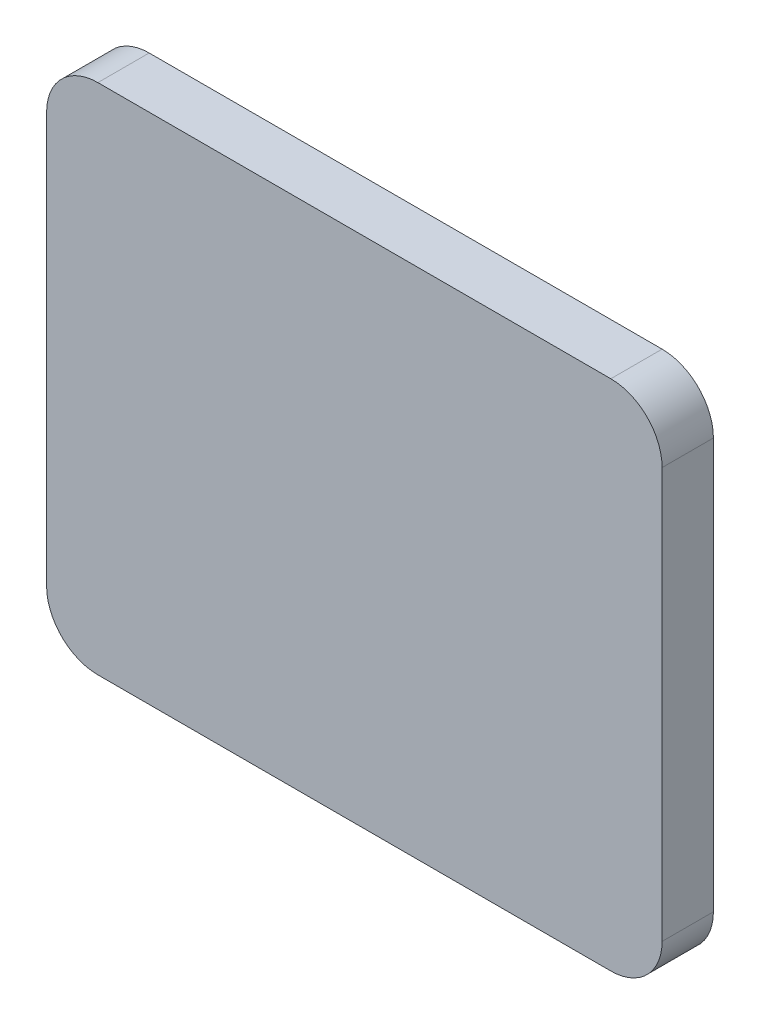
ISO-10303-21;
HEADER;
FILE_DESCRIPTION(('STEP AP214'),'2;1');
FILE_NAME('part.step','',(''),(''),'','','');
FILE_SCHEMA(('AUTOMOTIVE_DESIGN { 1 0 10303 214 1 1 1 1 }'));
ENDSEC;
DATA;
#1=APPLICATION_CONTEXT('core data for automotive mechanical design processes');
#2=APPLICATION_PROTOCOL_DEFINITION('international standard','automotive_design',2000,#1);
#3=PRODUCT_CONTEXT('',#1,'mechanical');
#4=PRODUCT('Part','Part','',(#3));
#5=PRODUCT_RELATED_PRODUCT_CATEGORY('part','',(#4));
#6=PRODUCT_DEFINITION_FORMATION('','',#4);
#7=PRODUCT_DEFINITION_CONTEXT('part definition',#1,'design');
#8=PRODUCT_DEFINITION('design','',#6,#7);
#9=PRODUCT_DEFINITION_SHAPE('','',#8);
#10=(LENGTH_UNIT() NAMED_UNIT(*) SI_UNIT(.MILLI.,.METRE.));
#11=(NAMED_UNIT(*) PLANE_ANGLE_UNIT() SI_UNIT($,.RADIAN.));
#12=(NAMED_UNIT(*) SI_UNIT($,.STERADIAN.) SOLID_ANGLE_UNIT());
#13=UNCERTAINTY_MEASURE_WITH_UNIT(LENGTH_MEASURE(1.E-05),#10,'distance_accuracy_value','');
#14=(GEOMETRIC_REPRESENTATION_CONTEXT(3) GLOBAL_UNCERTAINTY_ASSIGNED_CONTEXT((#13)) GLOBAL_UNIT_ASSIGNED_CONTEXT((#10,
#11,#12)) REPRESENTATION_CONTEXT('',''));
#15=CARTESIAN_POINT('',(0.,0.,0.));
#16=DIRECTION('',(0.,0.,1.));
#17=DIRECTION('',(1.,0.,0.));
#18=AXIS2_PLACEMENT_3D('',#15,#16,#17);
#19=CARTESIAN_POINT('',(-4.99999999994,-4.999999999969,1.));
#20=DIRECTION('',(0.,0.,-1.));
#21=DIRECTION('',(0.,1.,0.));
#22=AXIS2_PLACEMENT_3D('',#19,#20,#21);
#23=PLANE('',#22);
#24=CARTESIAN_POINT('',(5.000000000026,-4.000000000026,1.));
#25=DIRECTION('',(0.,0.,-1.));
#26=DIRECTION('',(0.,1.,0.));
#27=AXIS2_PLACEMENT_3D('',#24,#25,#26);
#28=CIRCLE('',#27,0.999999999974);
#29=CARTESIAN_POINT('',(6.,-4.000000000026,1.));
#30=VERTEX_POINT('',#29);
#31=CARTESIAN_POINT('',(5.000000000026,-4.999999999969,1.));
#32=VERTEX_POINT('',#31);
#33=EDGE_CURVE('E94',#30,#32,#28,.T.);
#34=ORIENTED_EDGE('',*,*,#33,.F.);
#35=DIRECTION('',(0.,1.,0.));
#36=VECTOR('',#35,1.);
#37=CARTESIAN_POINT('',(6.,-4.000000000026,1.));
#38=LINE('',#37,#36);
#39=CARTESIAN_POINT('',(6.,4.000000000018,1.));
#40=VERTEX_POINT('',#39);
#41=EDGE_CURVE('E103',#30,#40,#38,.T.);
#42=ORIENTED_EDGE('',*,*,#41,.T.);
#43=CARTESIAN_POINT('',(5.000000000026,4.000000000018,1.));
#44=DIRECTION('',(0.,0.,-1.));
#45=DIRECTION('',(0.,1.,0.));
#46=AXIS2_PLACEMENT_3D('',#43,#44,#45);
#47=CIRCLE('',#46,0.999999999974);
#48=CARTESIAN_POINT('',(5.000000000026,4.999999999992,1.));
#49=VERTEX_POINT('',#48);
#50=EDGE_CURVE('E106',#49,#40,#47,.T.);
#51=ORIENTED_EDGE('',*,*,#50,.F.);
#52=DIRECTION('',(1.,0.,0.));
#53=VECTOR('',#52,1.);
#54=CARTESIAN_POINT('',(5.000000000026,4.999999999992,1.));
#55=LINE('',#54,#53);
#56=CARTESIAN_POINT('',(-4.999999999989,4.999999999992,1.));
#57=VERTEX_POINT('',#56);
#58=EDGE_CURVE('E107',#49,#57,#55,.F.);
#59=ORIENTED_EDGE('',*,*,#58,.T.);
#60=CARTESIAN_POINT('',(-4.999999999989,4.000000000018,1.));
#61=DIRECTION('',(0.,0.,-1.));
#62=DIRECTION('',(0.,1.,0.));
#63=AXIS2_PLACEMENT_3D('',#60,#61,#62);
#64=CIRCLE('',#63,0.999999999974);
#65=CARTESIAN_POINT('',(-5.9999999999815,4.000000000025,1.));
#66=VERTEX_POINT('',#65);
#67=EDGE_CURVE('E110',#66,#57,#64,.T.);
#68=ORIENTED_EDGE('',*,*,#67,.F.);
#69=DIRECTION('',(0.,1.,0.));
#70=VECTOR('',#69,1.);
#71=CARTESIAN_POINT('',(-6.,4.00000000005,1.));
#72=LINE('',#71,#70);
#73=CARTESIAN_POINT('',(-6.,-3.999999999995,1.));
#74=VERTEX_POINT('',#73);
#75=EDGE_CURVE('E85',#66,#74,#72,.F.);
#76=ORIENTED_EDGE('',*,*,#75,.T.);
#77=CARTESIAN_POINT('',(-5.000000000026,-3.999999999995,1.));
#78=DIRECTION('',(0.,0.,-1.));
#79=DIRECTION('',(0.,1.,0.));
#80=AXIS2_PLACEMENT_3D('',#77,#78,#79);
#81=CIRCLE('',#80,0.999999999974);
#82=CARTESIAN_POINT('',(-4.999999999983,-4.999999999969,1.));
#83=VERTEX_POINT('',#82);
#84=EDGE_CURVE('E20',#83,#74,#81,.T.);
#85=ORIENTED_EDGE('',*,*,#84,.F.);
#86=DIRECTION('',(1.,0.,0.));
#87=VECTOR('',#86,1.);
#88=CARTESIAN_POINT('',(-4.99999999994,-4.999999999969,1.));
#89=LINE('',#88,#87);
#90=EDGE_CURVE('E83',#83,#32,#89,.T.);
#91=ORIENTED_EDGE('',*,*,#90,.T.);
#92=EDGE_LOOP('',(#34,#42,#51,#59,#68,#76,#85,#91));
#93=FACE_BOUND('',#92,.T.);
#94=ADVANCED_FACE('F17',(#93),#23,.F.);
#95=CARTESIAN_POINT('',(-5.000000000026,-3.999999999995,0.));
#96=DIRECTION('',(0.,0.,-1.));
#97=DIRECTION('',(0.,1.,0.));
#98=AXIS2_PLACEMENT_3D('',#95,#96,#97);
#99=CYLINDRICAL_SURFACE('',#98,0.999999999974);
#100=ORIENTED_EDGE('',*,*,#84,.T.);
#101=DIRECTION('',(0.,0.,-1.));
#102=VECTOR('',#101,1.);
#103=CARTESIAN_POINT('',(-6.,-3.999999999995,0.));
#104=LINE('',#103,#102);
#105=CARTESIAN_POINT('',(-6.,-3.999999999995,0.));
#106=VERTEX_POINT('',#105);
#107=EDGE_CURVE('E101',#74,#106,#104,.T.);
#108=ORIENTED_EDGE('',*,*,#107,.T.);
#109=CARTESIAN_POINT('',(-5.000000000026,-3.999999999995,0.));
#110=DIRECTION('',(0.,0.,-1.));
#111=DIRECTION('',(0.,1.,0.));
#112=AXIS2_PLACEMENT_3D('',#109,#110,#111);
#113=CIRCLE('',#112,0.999999999974);
#114=CARTESIAN_POINT('',(-4.999999999983,-4.9999999999765,0.));
#115=VERTEX_POINT('',#114);
#116=EDGE_CURVE('E92',#115,#106,#113,.T.);
#117=ORIENTED_EDGE('',*,*,#116,.F.);
#118=DIRECTION('',(0.,0.,1.));
#119=VECTOR('',#118,1.);
#120=CARTESIAN_POINT('',(-4.99999999994,-4.999999999969,0.));
#121=LINE('',#120,#119);
#122=EDGE_CURVE('E89',#115,#83,#121,.T.);
#123=ORIENTED_EDGE('',*,*,#122,.T.);
#124=EDGE_LOOP('',(#100,#108,#117,#123));
#125=FACE_BOUND('',#124,.T.);
#126=ADVANCED_FACE('F90',(#125),#99,.T.);
#127=CARTESIAN_POINT('',(-6.,4.00000000005,0.));
#128=DIRECTION('',(1.,0.,0.));
#129=DIRECTION('',(0.,0.,-1.));
#130=AXIS2_PLACEMENT_3D('',#127,#128,#129);
#131=PLANE('',#130);
#132=ORIENTED_EDGE('',*,*,#107,.F.);
#133=ORIENTED_EDGE('',*,*,#75,.F.);
#134=DIRECTION('',(0.,0.,-1.));
#135=VECTOR('',#134,1.);
#136=CARTESIAN_POINT('',(-5.999999999963,4.000000000032,0.));
#137=LINE('',#136,#135);
#138=CARTESIAN_POINT('',(-5.9999999999815,4.000000000025,0.));
#139=VERTEX_POINT('',#138);
#140=EDGE_CURVE('E129',#139,#66,#137,.F.);
#141=ORIENTED_EDGE('',*,*,#140,.F.);
#142=DIRECTION('',(0.,1.,0.));
#143=VECTOR('',#142,1.);
#144=CARTESIAN_POINT('',(-6.,-4.999999999969,0.));
#145=LINE('',#144,#143);
#146=EDGE_CURVE('E122',#106,#139,#145,.T.);
#147=ORIENTED_EDGE('',*,*,#146,.F.);
#148=EDGE_LOOP('',(#132,#133,#141,#147));
#149=FACE_BOUND('',#148,.T.);
#150=ADVANCED_FACE('F216',(#149),#131,.F.);
#151=CARTESIAN_POINT('',(-4.999999999989,4.000000000018,0.));
#152=DIRECTION('',(0.,0.,-1.));
#153=DIRECTION('',(0.,1.,0.));
#154=AXIS2_PLACEMENT_3D('',#151,#152,#153);
#155=CYLINDRICAL_SURFACE('',#154,0.999999999974);
#156=ORIENTED_EDGE('',*,*,#67,.T.);
#157=DIRECTION('',(0.,0.,-1.));
#158=VECTOR('',#157,1.);
#159=CARTESIAN_POINT('',(-4.999999999989,4.999999999992,0.));
#160=LINE('',#159,#158);
#161=CARTESIAN_POINT('',(-4.999999999989,4.999999999992,0.));
#162=VERTEX_POINT('',#161);
#163=EDGE_CURVE('E109',#57,#162,#160,.T.);
#164=ORIENTED_EDGE('',*,*,#163,.T.);
#165=CARTESIAN_POINT('',(-4.999999999989,4.000000000018,0.));
#166=DIRECTION('',(0.,0.,-1.));
#167=DIRECTION('',(0.,1.,0.));
#168=AXIS2_PLACEMENT_3D('',#165,#166,#167);
#169=CIRCLE('',#168,0.999999999974);
#170=EDGE_CURVE('E119',#139,#162,#169,.T.);
#171=ORIENTED_EDGE('',*,*,#170,.F.);
#172=ORIENTED_EDGE('',*,*,#140,.T.);
#173=EDGE_LOOP('',(#156,#164,#171,#172));
#174=FACE_BOUND('',#173,.T.);
#175=ADVANCED_FACE('F206',(#174),#155,.T.);
#176=CARTESIAN_POINT('',(5.000000000026,4.999999999992,0.));
#177=DIRECTION('',(0.,-1.,0.));
#178=DIRECTION('',(0.,0.,-1.));
#179=AXIS2_PLACEMENT_3D('',#176,#177,#178);
#180=PLANE('',#179);
#181=ORIENTED_EDGE('',*,*,#163,.F.);
#182=ORIENTED_EDGE('',*,*,#58,.F.);
#183=DIRECTION('',(0.,0.,-1.));
#184=VECTOR('',#183,1.);
#185=CARTESIAN_POINT('',(5.000000000026,4.999999999992,0.));
#186=LINE('',#185,#184);
#187=CARTESIAN_POINT('',(5.000000000026,4.999999999992,0.));
#188=VERTEX_POINT('',#187);
#189=EDGE_CURVE('E127',#188,#49,#186,.F.);
#190=ORIENTED_EDGE('',*,*,#189,.F.);
#191=DIRECTION('',(1.,0.,0.));
#192=VECTOR('',#191,1.);
#193=CARTESIAN_POINT('',(-4.99999999994,4.999999999992,0.));
#194=LINE('',#193,#192);
#195=EDGE_CURVE('E118',#162,#188,#194,.T.);
#196=ORIENTED_EDGE('',*,*,#195,.F.);
#197=EDGE_LOOP('',(#181,#182,#190,#196));
#198=FACE_BOUND('',#197,.T.);
#199=ADVANCED_FACE('F196',(#198),#180,.F.);
#200=CARTESIAN_POINT('',(5.000000000026,4.000000000018,0.));
#201=DIRECTION('',(0.,0.,-1.));
#202=DIRECTION('',(0.,1.,0.));
#203=AXIS2_PLACEMENT_3D('',#200,#201,#202);
#204=CYLINDRICAL_SURFACE('',#203,0.999999999974);
#205=ORIENTED_EDGE('',*,*,#50,.T.);
#206=DIRECTION('',(0.,0.,1.));
#207=VECTOR('',#206,1.);
#208=CARTESIAN_POINT('',(6.,4.000000000018,0.));
#209=LINE('',#208,#207);
#210=CARTESIAN_POINT('',(6.,4.000000000018,0.));
#211=VERTEX_POINT('',#210);
#212=EDGE_CURVE('E105',#40,#211,#209,.F.);
#213=ORIENTED_EDGE('',*,*,#212,.T.);
#214=CARTESIAN_POINT('',(5.000000000026,4.000000000018,0.));
#215=DIRECTION('',(0.,0.,-1.));
#216=DIRECTION('',(0.,1.,0.));
#217=AXIS2_PLACEMENT_3D('',#214,#215,#216);
#218=CIRCLE('',#217,0.999999999974);
#219=EDGE_CURVE('E115',#188,#211,#218,.T.);
#220=ORIENTED_EDGE('',*,*,#219,.F.);
#221=ORIENTED_EDGE('',*,*,#189,.T.);
#222=EDGE_LOOP('',(#205,#213,#220,#221));
#223=FACE_BOUND('',#222,.T.);
#224=ADVANCED_FACE('F162',(#223),#204,.T.);
#225=CARTESIAN_POINT('',(6.,-4.000000000026,0.));
#226=DIRECTION('',(-1.,0.,0.));
#227=DIRECTION('',(0.,0.,1.));
#228=AXIS2_PLACEMENT_3D('',#225,#226,#227);
#229=PLANE('',#228);
#230=ORIENTED_EDGE('',*,*,#212,.F.);
#231=ORIENTED_EDGE('',*,*,#41,.F.);
#232=DIRECTION('',(0.,0.,-1.));
#233=VECTOR('',#232,1.);
#234=CARTESIAN_POINT('',(6.,-4.000000000026,0.));
#235=LINE('',#234,#233);
#236=CARTESIAN_POINT('',(6.,-4.000000000026,0.));
#237=VERTEX_POINT('',#236);
#238=EDGE_CURVE('E125',#237,#30,#235,.F.);
#239=ORIENTED_EDGE('',*,*,#238,.F.);
#240=DIRECTION('',(0.,1.,0.));
#241=VECTOR('',#240,1.);
#242=CARTESIAN_POINT('',(6.,-4.999999999969,0.));
#243=LINE('',#242,#241);
#244=EDGE_CURVE('E114',#211,#237,#243,.F.);
#245=ORIENTED_EDGE('',*,*,#244,.F.);
#246=EDGE_LOOP('',(#230,#231,#239,#245));
#247=FACE_BOUND('',#246,.T.);
#248=ADVANCED_FACE('F152',(#247),#229,.F.);
#249=CARTESIAN_POINT('',(5.000000000026,-4.000000000026,0.));
#250=DIRECTION('',(0.,0.,-1.));
#251=DIRECTION('',(0.,1.,0.));
#252=AXIS2_PLACEMENT_3D('',#249,#250,#251);
#253=CYLINDRICAL_SURFACE('',#252,0.999999999974);
#254=ORIENTED_EDGE('',*,*,#33,.T.);
#255=DIRECTION('',(0.,0.,1.));
#256=VECTOR('',#255,1.);
#257=CARTESIAN_POINT('',(5.000000000026,-4.999999999969,0.));
#258=LINE('',#257,#256);
#259=CARTESIAN_POINT('',(5.000000000026,-4.9999999999765,0.));
#260=VERTEX_POINT('',#259);
#261=EDGE_CURVE('E35',#32,#260,#258,.F.);
#262=ORIENTED_EDGE('',*,*,#261,.T.);
#263=CARTESIAN_POINT('',(5.000000000026,-4.000000000026,0.));
#264=DIRECTION('',(0.,0.,-1.));
#265=DIRECTION('',(0.,1.,0.));
#266=AXIS2_PLACEMENT_3D('',#263,#264,#265);
#267=CIRCLE('',#266,0.999999999974);
#268=EDGE_CURVE('E26',#237,#260,#267,.T.);
#269=ORIENTED_EDGE('',*,*,#268,.F.);
#270=ORIENTED_EDGE('',*,*,#238,.T.);
#271=EDGE_LOOP('',(#254,#262,#269,#270));
#272=FACE_BOUND('',#271,.T.);
#273=ADVANCED_FACE('F153',(#272),#253,.T.);
#274=CARTESIAN_POINT('',(-4.99999999994,-4.999999999969,0.));
#275=DIRECTION('',(0.,1.,0.));
#276=DIRECTION('',(0.,0.,1.));
#277=AXIS2_PLACEMENT_3D('',#274,#275,#276);
#278=PLANE('',#277);
#279=ORIENTED_EDGE('',*,*,#261,.F.);
#280=ORIENTED_EDGE('',*,*,#90,.F.);
#281=ORIENTED_EDGE('',*,*,#122,.F.);
#282=DIRECTION('',(1.,0.,0.));
#283=VECTOR('',#282,1.);
#284=CARTESIAN_POINT('',(-4.99999999994,-4.999999999984,0.));
#285=LINE('',#284,#283);
#286=EDGE_CURVE('E11',#260,#115,#285,.F.);
#287=ORIENTED_EDGE('',*,*,#286,.F.);
#288=EDGE_LOOP('',(#279,#280,#281,#287));
#289=FACE_BOUND('',#288,.T.);
#290=ADVANCED_FACE('F96',(#289),#278,.F.);
#291=CARTESIAN_POINT('',(-4.99999999994,-4.999999999969,0.));
#292=DIRECTION('',(0.,0.,-1.));
#293=DIRECTION('',(0.,1.,0.));
#294=AXIS2_PLACEMENT_3D('',#291,#292,#293);
#295=PLANE('',#294);
#296=ORIENTED_EDGE('',*,*,#268,.T.);
#297=ORIENTED_EDGE('',*,*,#286,.T.);
#298=ORIENTED_EDGE('',*,*,#116,.T.);
#299=ORIENTED_EDGE('',*,*,#146,.T.);
#300=ORIENTED_EDGE('',*,*,#170,.T.);
#301=ORIENTED_EDGE('',*,*,#195,.T.);
#302=ORIENTED_EDGE('',*,*,#219,.T.);
#303=ORIENTED_EDGE('',*,*,#244,.T.);
#304=EDGE_LOOP('',(#296,#297,#298,#299,#300,#301,#302,#303));
#305=FACE_BOUND('',#304,.T.);
#306=ADVANCED_FACE('F148',(#305),#295,.T.);
#307=CLOSED_SHELL('',(#94,#126,#150,#175,#199,#224,#248,#273,#290,#306));
#308=MANIFOLD_SOLID_BREP('B1',#307);
#309=ADVANCED_BREP_SHAPE_REPRESENTATION('',(#18,#308),#14);
#310=SHAPE_DEFINITION_REPRESENTATION(#9,#309);
ENDSEC;
END-ISO-10303-21;
